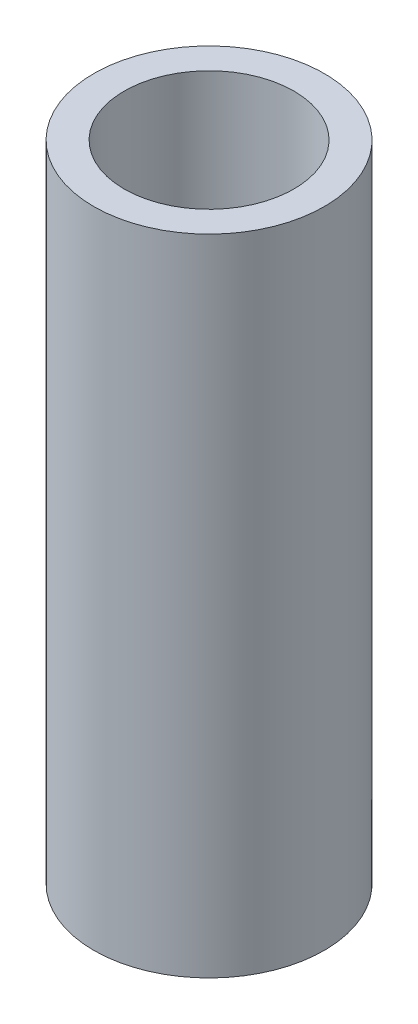
ISO-10303-21;
HEADER;
FILE_DESCRIPTION(('STEP AP214'),'2;1');
FILE_NAME('part.step','',(''),(''),'','','');
FILE_SCHEMA(('AUTOMOTIVE_DESIGN { 1 0 10303 214 1 1 1 1 }'));
ENDSEC;
DATA;
#1=APPLICATION_CONTEXT('core data for automotive mechanical design processes');
#2=APPLICATION_PROTOCOL_DEFINITION('international standard','automotive_design',2000,#1);
#3=PRODUCT_CONTEXT('',#1,'mechanical');
#4=PRODUCT('Part','Part','',(#3));
#5=PRODUCT_RELATED_PRODUCT_CATEGORY('part','',(#4));
#6=PRODUCT_DEFINITION_FORMATION('','',#4);
#7=PRODUCT_DEFINITION_CONTEXT('part definition',#1,'design');
#8=PRODUCT_DEFINITION('design','',#6,#7);
#9=PRODUCT_DEFINITION_SHAPE('','',#8);
#10=(LENGTH_UNIT() NAMED_UNIT(*) SI_UNIT(.MILLI.,.METRE.));
#11=(NAMED_UNIT(*) PLANE_ANGLE_UNIT() SI_UNIT($,.RADIAN.));
#12=(NAMED_UNIT(*) SI_UNIT($,.STERADIAN.) SOLID_ANGLE_UNIT());
#13=UNCERTAINTY_MEASURE_WITH_UNIT(LENGTH_MEASURE(1.E-05),#10,'distance_accuracy_value','');
#14=(GEOMETRIC_REPRESENTATION_CONTEXT(3) GLOBAL_UNCERTAINTY_ASSIGNED_CONTEXT((#13)) GLOBAL_UNIT_ASSIGNED_CONTEXT((#10,
#11,#12)) REPRESENTATION_CONTEXT('',''));
#15=CARTESIAN_POINT('',(0.,0.,0.));
#16=DIRECTION('',(0.,0.,1.));
#17=DIRECTION('',(1.,0.,0.));
#18=AXIS2_PLACEMENT_3D('',#15,#16,#17);
#19=CARTESIAN_POINT('',(0.,69.8691571301008,0.));
#20=DIRECTION('',(0.,-1.,0.));
#21=DIRECTION('',(0.,0.,-1.));
#22=AXIS2_PLACEMENT_3D('',#19,#20,#21);
#23=CYLINDRICAL_SURFACE('',#22,12.5);
#24=CARTESIAN_POINT('',(0.,69.8691571301008,0.));
#25=DIRECTION('',(0.,1.,0.));
#26=DIRECTION('',(0.,0.,1.));
#27=AXIS2_PLACEMENT_3D('',#24,#25,#26);
#28=CIRCLE('',#27,12.5);
#29=CARTESIAN_POINT('',(0.,69.8691571301008,12.5));
#30=VERTEX_POINT('',#29);
#31=EDGE_CURVE('E10',#30,#30,#28,.T.);
#32=ORIENTED_EDGE('',*,*,#31,.F.);
#33=EDGE_LOOP('',(#32));
#34=FACE_BOUND('',#33,.T.);
#35=CARTESIAN_POINT('',(0.,0.,0.));
#36=DIRECTION('',(0.,1.,0.));
#37=DIRECTION('',(0.,0.,1.));
#38=AXIS2_PLACEMENT_3D('',#35,#36,#37);
#39=CIRCLE('',#38,12.5);
#40=CARTESIAN_POINT('',(0.,0.,12.5));
#41=VERTEX_POINT('',#40);
#42=EDGE_CURVE('E37',#41,#41,#39,.T.);
#43=ORIENTED_EDGE('',*,*,#42,.T.);
#44=EDGE_LOOP('',(#43));
#45=FACE_BOUND('',#44,.T.);
#46=ADVANCED_FACE('F40',(#34,#45),#23,.T.);
#47=CARTESIAN_POINT('',(0.,69.8691571301008,0.));
#48=DIRECTION('',(0.,1.,0.));
#49=DIRECTION('',(0.,0.,1.));
#50=AXIS2_PLACEMENT_3D('',#47,#48,#49);
#51=PLANE('',#50);
#52=CARTESIAN_POINT('',(0.,69.8691571301008,0.));
#53=DIRECTION('',(0.,1.,0.));
#54=DIRECTION('',(0.,0.,1.));
#55=AXIS2_PLACEMENT_3D('',#52,#53,#54);
#56=CIRCLE('',#55,9.20537088301919);
#57=CARTESIAN_POINT('',(0.,69.8691571301008,9.20537088301919));
#58=VERTEX_POINT('',#57);
#59=EDGE_CURVE('E50',#58,#58,#56,.T.);
#60=ORIENTED_EDGE('',*,*,#59,.F.);
#61=EDGE_LOOP('',(#60));
#62=FACE_BOUND('',#61,.T.);
#63=ORIENTED_EDGE('',*,*,#31,.T.);
#64=EDGE_LOOP('',(#63));
#65=FACE_BOUND('',#64,.T.);
#66=ADVANCED_FACE('F59',(#62,#65),#51,.T.);
#67=CARTESIAN_POINT('',(0.,0.,0.));
#68=DIRECTION('',(0.,1.,0.));
#69=DIRECTION('',(0.,0.,1.));
#70=AXIS2_PLACEMENT_3D('',#67,#68,#69);
#71=PLANE('',#70);
#72=CARTESIAN_POINT('',(0.,0.,0.));
#73=DIRECTION('',(0.,1.,0.));
#74=DIRECTION('',(0.,0.,1.));
#75=AXIS2_PLACEMENT_3D('',#72,#73,#74);
#76=CIRCLE('',#75,9.20537088301919);
#77=CARTESIAN_POINT('',(0.,0.,9.20537088301919));
#78=VERTEX_POINT('',#77);
#79=EDGE_CURVE('E47',#78,#78,#76,.T.);
#80=ORIENTED_EDGE('',*,*,#79,.T.);
#81=EDGE_LOOP('',(#80));
#82=FACE_BOUND('',#81,.T.);
#83=ORIENTED_EDGE('',*,*,#42,.F.);
#84=EDGE_LOOP('',(#83));
#85=FACE_BOUND('',#84,.T.);
#86=ADVANCED_FACE('F58',(#82,#85),#71,.F.);
#87=CARTESIAN_POINT('',(0.,69.8691571301008,0.));
#88=DIRECTION('',(0.,-1.,0.));
#89=DIRECTION('',(0.,0.,-1.));
#90=AXIS2_PLACEMENT_3D('',#87,#88,#89);
#91=CYLINDRICAL_SURFACE('',#90,9.20537088301919);
#92=ORIENTED_EDGE('',*,*,#59,.T.);
#93=EDGE_LOOP('',(#92));
#94=FACE_BOUND('',#93,.T.);
#95=ORIENTED_EDGE('',*,*,#79,.F.);
#96=EDGE_LOOP('',(#95));
#97=FACE_BOUND('',#96,.T.);
#98=ADVANCED_FACE('F54',(#94,#97),#91,.F.);
#99=CLOSED_SHELL('',(#46,#66,#86,#98));
#100=MANIFOLD_SOLID_BREP('B2',#99);
#101=ADVANCED_BREP_SHAPE_REPRESENTATION('',(#18,#100),#14);
#102=SHAPE_DEFINITION_REPRESENTATION(#9,#101);
ENDSEC;
END-ISO-10303-21;
